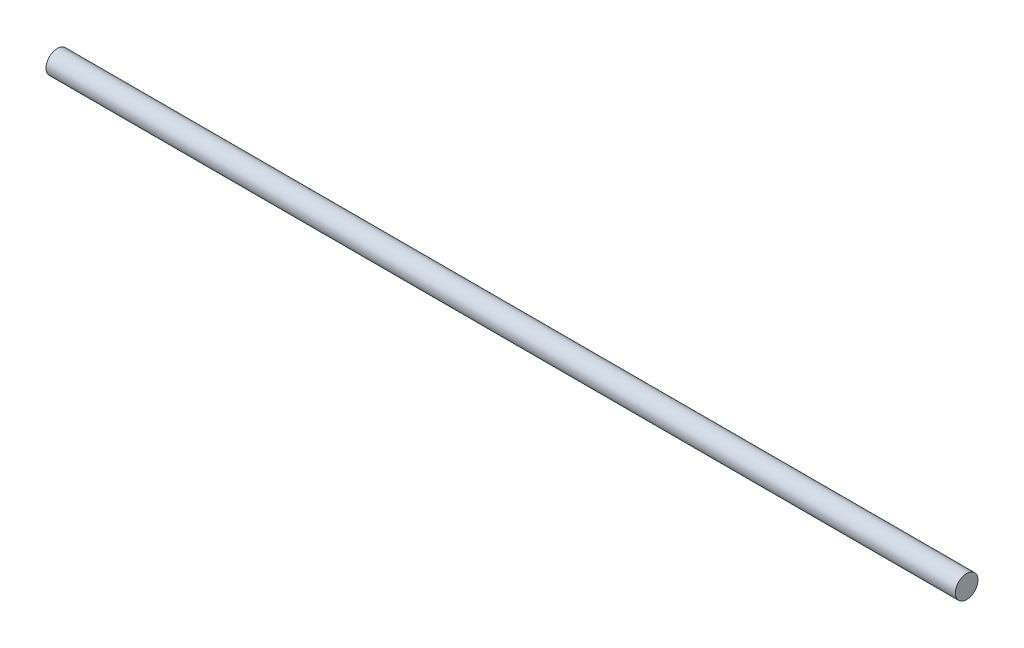
ISO-10303-21;
HEADER;
FILE_DESCRIPTION(('STEP AP214'),'2;1');
FILE_NAME('part.step','',(''),(''),'','','');
FILE_SCHEMA(('AUTOMOTIVE_DESIGN { 1 0 10303 214 1 1 1 1 }'));
ENDSEC;
DATA;
#1=APPLICATION_CONTEXT('core data for automotive mechanical design processes');
#2=APPLICATION_PROTOCOL_DEFINITION('international standard','automotive_design',2000,#1);
#3=PRODUCT_CONTEXT('',#1,'mechanical');
#4=PRODUCT('Part','Part','',(#3));
#5=PRODUCT_RELATED_PRODUCT_CATEGORY('part','',(#4));
#6=PRODUCT_DEFINITION_FORMATION('','',#4);
#7=PRODUCT_DEFINITION_CONTEXT('part definition',#1,'design');
#8=PRODUCT_DEFINITION('design','',#6,#7);
#9=PRODUCT_DEFINITION_SHAPE('','',#8);
#10=(LENGTH_UNIT() NAMED_UNIT(*) SI_UNIT(.MILLI.,.METRE.));
#11=(NAMED_UNIT(*) PLANE_ANGLE_UNIT() SI_UNIT($,.RADIAN.));
#12=(NAMED_UNIT(*) SI_UNIT($,.STERADIAN.) SOLID_ANGLE_UNIT());
#13=UNCERTAINTY_MEASURE_WITH_UNIT(LENGTH_MEASURE(1.E-05),#10,'distance_accuracy_value','');
#14=(GEOMETRIC_REPRESENTATION_CONTEXT(3) GLOBAL_UNCERTAINTY_ASSIGNED_CONTEXT((#13)) GLOBAL_UNIT_ASSIGNED_CONTEXT((#10,
#11,#12)) REPRESENTATION_CONTEXT('',''));
#15=CARTESIAN_POINT('',(0.,0.,0.));
#16=DIRECTION('',(0.,0.,1.));
#17=DIRECTION('',(1.,0.,0.));
#18=AXIS2_PLACEMENT_3D('',#15,#16,#17);
#19=CARTESIAN_POINT('',(2000.,0.,0.));
#20=DIRECTION('',(-1.,0.,0.));
#21=DIRECTION('',(0.,0.,1.));
#22=AXIS2_PLACEMENT_3D('',#19,#20,#21);
#23=CYLINDRICAL_SURFACE('',#22,24.95);
#24=CARTESIAN_POINT('',(2000.,0.,0.));
#25=DIRECTION('',(1.,0.,0.));
#26=DIRECTION('',(0.,0.,-1.));
#27=AXIS2_PLACEMENT_3D('',#24,#25,#26);
#28=CIRCLE('',#27,24.95);
#29=CARTESIAN_POINT('',(2000.,0.,-24.95));
#30=VERTEX_POINT('',#29);
#31=EDGE_CURVE('E10',#30,#30,#28,.T.);
#32=ORIENTED_EDGE('',*,*,#31,.F.);
#33=EDGE_LOOP('',(#32));
#34=FACE_BOUND('',#33,.T.);
#35=CARTESIAN_POINT('',(0.,0.,0.));
#36=DIRECTION('',(1.,0.,0.));
#37=DIRECTION('',(0.,0.,-1.));
#38=AXIS2_PLACEMENT_3D('',#35,#36,#37);
#39=CIRCLE('',#38,24.95);
#40=CARTESIAN_POINT('',(0.,0.,-24.95));
#41=VERTEX_POINT('',#40);
#42=EDGE_CURVE('E33',#41,#41,#39,.T.);
#43=ORIENTED_EDGE('',*,*,#42,.T.);
#44=EDGE_LOOP('',(#43));
#45=FACE_BOUND('',#44,.T.);
#46=ADVANCED_FACE('F30',(#34,#45),#23,.T.);
#47=CARTESIAN_POINT('',(2000.,0.,0.));
#48=DIRECTION('',(1.,0.,0.));
#49=DIRECTION('',(0.,0.,-1.));
#50=AXIS2_PLACEMENT_3D('',#47,#48,#49);
#51=PLANE('',#50);
#52=ORIENTED_EDGE('',*,*,#31,.T.);
#53=EDGE_LOOP('',(#52));
#54=FACE_BOUND('',#53,.T.);
#55=ADVANCED_FACE('F45',(#54),#51,.T.);
#56=CARTESIAN_POINT('',(0.,0.,0.));
#57=DIRECTION('',(1.,0.,0.));
#58=DIRECTION('',(0.,0.,-1.));
#59=AXIS2_PLACEMENT_3D('',#56,#57,#58);
#60=PLANE('',#59);
#61=ORIENTED_EDGE('',*,*,#42,.F.);
#62=EDGE_LOOP('',(#61));
#63=FACE_BOUND('',#62,.T.);
#64=ADVANCED_FACE('F43',(#63),#60,.F.);
#65=CLOSED_SHELL('',(#46,#55,#64));
#66=MANIFOLD_SOLID_BREP('B2',#65);
#67=ADVANCED_BREP_SHAPE_REPRESENTATION('',(#18,#66),#14);
#68=SHAPE_DEFINITION_REPRESENTATION(#9,#67);
ENDSEC;
END-ISO-10303-21;
